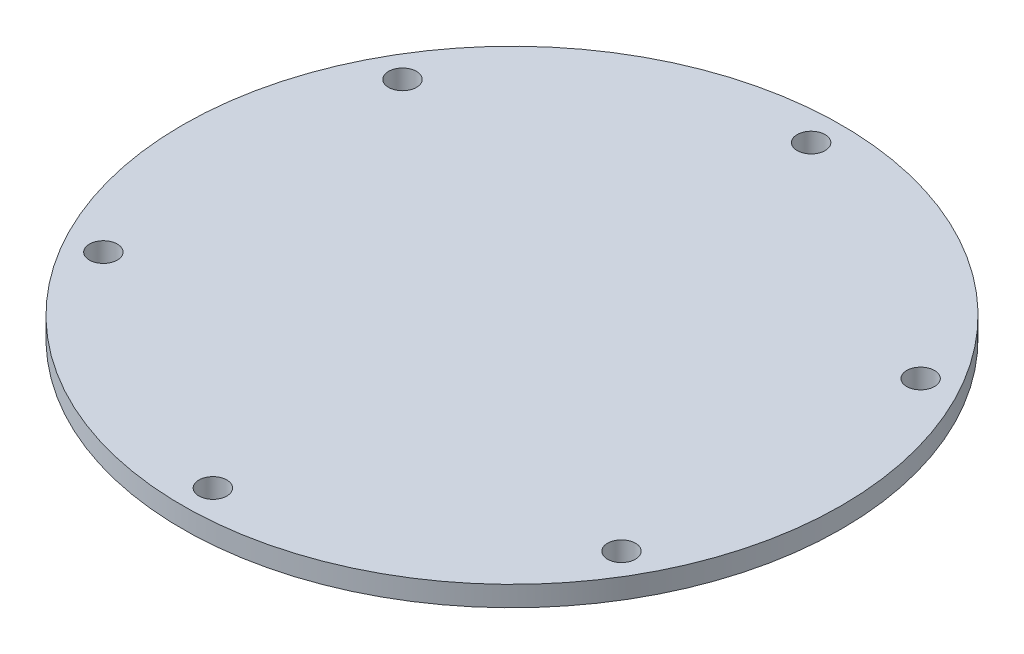
ISO-10303-21;
HEADER;
FILE_DESCRIPTION(('STEP AP214'),'2;1');
FILE_NAME('part.step','',(''),(''),'','','');
FILE_SCHEMA(('AUTOMOTIVE_DESIGN { 1 0 10303 214 1 1 1 1 }'));
ENDSEC;
DATA;
#1=APPLICATION_CONTEXT('core data for automotive mechanical design processes');
#2=APPLICATION_PROTOCOL_DEFINITION('international standard','automotive_design',2000,#1);
#3=PRODUCT_CONTEXT('',#1,'mechanical');
#4=PRODUCT('Part','Part','',(#3));
#5=PRODUCT_RELATED_PRODUCT_CATEGORY('part','',(#4));
#6=PRODUCT_DEFINITION_FORMATION('','',#4);
#7=PRODUCT_DEFINITION_CONTEXT('part definition',#1,'design');
#8=PRODUCT_DEFINITION('design','',#6,#7);
#9=PRODUCT_DEFINITION_SHAPE('','',#8);
#10=(LENGTH_UNIT() NAMED_UNIT(*) SI_UNIT(.MILLI.,.METRE.));
#11=(NAMED_UNIT(*) PLANE_ANGLE_UNIT() SI_UNIT($,.RADIAN.));
#12=(NAMED_UNIT(*) SI_UNIT($,.STERADIAN.) SOLID_ANGLE_UNIT());
#13=UNCERTAINTY_MEASURE_WITH_UNIT(LENGTH_MEASURE(1.E-05),#10,'distance_accuracy_value','');
#14=(GEOMETRIC_REPRESENTATION_CONTEXT(3) GLOBAL_UNCERTAINTY_ASSIGNED_CONTEXT((#13)) GLOBAL_UNIT_ASSIGNED_CONTEXT((#10,
#11,#12)) REPRESENTATION_CONTEXT('',''));
#15=CARTESIAN_POINT('',(0.,0.,0.));
#16=DIRECTION('',(0.,0.,1.));
#17=DIRECTION('',(1.,0.,0.));
#18=AXIS2_PLACEMENT_3D('',#15,#16,#17);
#19=CARTESIAN_POINT('',(-65.,-4.00000000000001,0.));
#20=DIRECTION('',(0.,-1.,0.));
#21=DIRECTION('',(1.,0.,0.));
#22=AXIS2_PLACEMENT_3D('',#19,#20,#21);
#23=PLANE('',#22);
#24=CARTESIAN_POINT('',(-51.0954988232815,-4.00000000000001,-29.5000000000006));
#25=DIRECTION('',(0.,-1.,0.));
#26=DIRECTION('',(0.,0.,-1.));
#27=AXIS2_PLACEMENT_3D('',#24,#25,#26);
#28=CIRCLE('',#27,2.74999999999999);
#29=CARTESIAN_POINT('',(-51.0954988232815,-4.00000000000001,-32.2500000000006));
#30=VERTEX_POINT('',#29);
#31=EDGE_CURVE('E181',#30,#30,#28,.T.);
#32=ORIENTED_EDGE('',*,*,#31,.F.);
#33=EDGE_LOOP('',(#32));
#34=FACE_BOUND('',#33,.T.);
#35=CARTESIAN_POINT('',(-51.0954988232822,-4.00000000000001,29.4999999999995));
#36=DIRECTION('',(0.,-1.,0.));
#37=DIRECTION('',(0.,0.,-1.));
#38=AXIS2_PLACEMENT_3D('',#35,#36,#37);
#39=CIRCLE('',#38,2.74999999999999);
#40=CARTESIAN_POINT('',(-51.0954988232822,-4.00000000000001,26.7499999999995));
#41=VERTEX_POINT('',#40);
#42=EDGE_CURVE('E101',#41,#41,#39,.T.);
#43=ORIENTED_EDGE('',*,*,#42,.F.);
#44=EDGE_LOOP('',(#43));
#45=FACE_BOUND('',#44,.T.);
#46=CARTESIAN_POINT('',(0.,-3.99999999999999,59.));
#47=DIRECTION('',(0.,-1.,0.));
#48=DIRECTION('',(0.,0.,-1.));
#49=AXIS2_PLACEMENT_3D('',#46,#47,#48);
#50=CIRCLE('',#49,2.74999999999999);
#51=CARTESIAN_POINT('',(0.,-3.99999999999999,56.25));
#52=VERTEX_POINT('',#51);
#53=EDGE_CURVE('E114',#52,#52,#50,.T.);
#54=ORIENTED_EDGE('',*,*,#53,.F.);
#55=EDGE_LOOP('',(#54));
#56=FACE_BOUND('',#55,.T.);
#57=CARTESIAN_POINT('',(51.0954988232818,-3.99999999999998,29.5000000000002));
#58=DIRECTION('',(0.,-1.,0.));
#59=DIRECTION('',(0.,0.,-1.));
#60=AXIS2_PLACEMENT_3D('',#57,#58,#59);
#61=CIRCLE('',#60,2.74999999999999);
#62=CARTESIAN_POINT('',(51.0954988232818,-3.99999999999998,26.7500000000003));
#63=VERTEX_POINT('',#62);
#64=EDGE_CURVE('E128',#63,#63,#61,.T.);
#65=ORIENTED_EDGE('',*,*,#64,.F.);
#66=EDGE_LOOP('',(#65));
#67=FACE_BOUND('',#66,.T.);
#68=CARTESIAN_POINT('',(51.095498823282,-3.99999999999998,-29.4999999999999));
#69=DIRECTION('',(0.,-1.,0.));
#70=DIRECTION('',(0.,0.,-1.));
#71=AXIS2_PLACEMENT_3D('',#68,#69,#70);
#72=CIRCLE('',#71,2.74999999999999);
#73=CARTESIAN_POINT('',(51.095498823282,-3.99999999999998,-32.2499999999999));
#74=VERTEX_POINT('',#73);
#75=EDGE_CURVE('E137',#74,#74,#72,.T.);
#76=ORIENTED_EDGE('',*,*,#75,.F.);
#77=EDGE_LOOP('',(#76));
#78=FACE_BOUND('',#77,.T.);
#79=CARTESIAN_POINT('',(0.,-3.99999999999999,-59.));
#80=DIRECTION('',(0.,-1.,0.));
#81=DIRECTION('',(0.,0.,-1.));
#82=AXIS2_PLACEMENT_3D('',#79,#80,#81);
#83=CIRCLE('',#82,2.74999999999999);
#84=CARTESIAN_POINT('',(0.,-3.99999999999999,-61.75));
#85=VERTEX_POINT('',#84);
#86=EDGE_CURVE('E145',#85,#85,#83,.T.);
#87=ORIENTED_EDGE('',*,*,#86,.F.);
#88=EDGE_LOOP('',(#87));
#89=FACE_BOUND('',#88,.T.);
#90=CARTESIAN_POINT('',(0.,-3.99999999999999,0.));
#91=DIRECTION('',(0.,1.,0.));
#92=DIRECTION('',(-1.,0.,0.));
#93=AXIS2_PLACEMENT_3D('',#90,#91,#92);
#94=CIRCLE('',#93,44.);
#95=CARTESIAN_POINT('',(-44.,-4.,0.));
#96=VERTEX_POINT('',#95);
#97=EDGE_CURVE('E80',#96,#96,#94,.T.);
#98=ORIENTED_EDGE('',*,*,#97,.T.);
#99=EDGE_LOOP('',(#98));
#100=FACE_BOUND('',#99,.T.);
#101=CARTESIAN_POINT('',(0.,-3.99999999999999,0.));
#102=DIRECTION('',(0.,1.,0.));
#103=DIRECTION('',(-1.,0.,0.));
#104=AXIS2_PLACEMENT_3D('',#101,#102,#103);
#105=CIRCLE('',#104,65.);
#106=CARTESIAN_POINT('',(-65.,-4.00000000000001,0.));
#107=VERTEX_POINT('',#106);
#108=EDGE_CURVE('E11',#107,#107,#105,.T.);
#109=ORIENTED_EDGE('',*,*,#108,.F.);
#110=EDGE_LOOP('',(#109));
#111=FACE_BOUND('',#110,.T.);
#112=ADVANCED_FACE('F45',(#34,#45,#56,#67,#78,#89,#100,#111),#23,.T.);
#113=CARTESIAN_POINT('',(0.,59.4980386112404,0.));
#114=DIRECTION('',(0.,1.,0.));
#115=DIRECTION('',(-1.,0.,0.));
#116=AXIS2_PLACEMENT_3D('',#113,#114,#115);
#117=CYLINDRICAL_SURFACE('',#116,65.);
#118=ORIENTED_EDGE('',*,*,#108,.T.);
#119=EDGE_LOOP('',(#118));
#120=FACE_BOUND('',#119,.T.);
#121=CARTESIAN_POINT('',(0.,0.,0.));
#122=DIRECTION('',(0.,1.,0.));
#123=DIRECTION('',(-1.,0.,0.));
#124=AXIS2_PLACEMENT_3D('',#121,#122,#123);
#125=CIRCLE('',#124,65.);
#126=CARTESIAN_POINT('',(-65.,0.,0.));
#127=VERTEX_POINT('',#126);
#128=EDGE_CURVE('E53',#127,#127,#125,.T.);
#129=ORIENTED_EDGE('',*,*,#128,.F.);
#130=EDGE_LOOP('',(#129));
#131=FACE_BOUND('',#130,.T.);
#132=ADVANCED_FACE('F173',(#120,#131),#117,.T.);
#133=CARTESIAN_POINT('',(0.,0.,0.));
#134=DIRECTION('',(0.,1.,0.));
#135=DIRECTION('',(-1.,0.,0.));
#136=AXIS2_PLACEMENT_3D('',#133,#134,#135);
#137=PLANE('',#136);
#138=CARTESIAN_POINT('',(-51.0954988232815,0.,-29.5000000000006));
#139=DIRECTION('',(0.,-1.,0.));
#140=DIRECTION('',(0.,0.,-1.));
#141=AXIS2_PLACEMENT_3D('',#138,#139,#140);
#142=CIRCLE('',#141,2.75);
#143=CARTESIAN_POINT('',(-51.0954988232815,0.,-32.2500000000006));
#144=VERTEX_POINT('',#143);
#145=EDGE_CURVE('E108',#144,#144,#142,.T.);
#146=ORIENTED_EDGE('',*,*,#145,.T.);
#147=EDGE_LOOP('',(#146));
#148=FACE_BOUND('',#147,.T.);
#149=CARTESIAN_POINT('',(-51.0954988232822,0.,29.4999999999995));
#150=DIRECTION('',(0.,-1.,0.));
#151=DIRECTION('',(0.,0.,-1.));
#152=AXIS2_PLACEMENT_3D('',#149,#150,#151);
#153=CIRCLE('',#152,2.75);
#154=CARTESIAN_POINT('',(-51.0954988232822,0.,26.7499999999995));
#155=VERTEX_POINT('',#154);
#156=EDGE_CURVE('E107',#155,#155,#153,.T.);
#157=ORIENTED_EDGE('',*,*,#156,.T.);
#158=EDGE_LOOP('',(#157));
#159=FACE_BOUND('',#158,.T.);
#160=CARTESIAN_POINT('',(0.,0.,59.));
#161=DIRECTION('',(0.,-1.,0.));
#162=DIRECTION('',(0.,0.,-1.));
#163=AXIS2_PLACEMENT_3D('',#160,#161,#162);
#164=CIRCLE('',#163,2.75);
#165=CARTESIAN_POINT('',(0.,0.,56.25));
#166=VERTEX_POINT('',#165);
#167=EDGE_CURVE('E123',#166,#166,#164,.T.);
#168=ORIENTED_EDGE('',*,*,#167,.T.);
#169=EDGE_LOOP('',(#168));
#170=FACE_BOUND('',#169,.T.);
#171=CARTESIAN_POINT('',(51.0954988232818,0.,29.5000000000002));
#172=DIRECTION('',(0.,-1.,0.));
#173=DIRECTION('',(0.,0.,-1.));
#174=AXIS2_PLACEMENT_3D('',#171,#172,#173);
#175=CIRCLE('',#174,2.75);
#176=CARTESIAN_POINT('',(51.0954988232818,0.,26.7500000000003));
#177=VERTEX_POINT('',#176);
#178=EDGE_CURVE('E132',#177,#177,#175,.T.);
#179=ORIENTED_EDGE('',*,*,#178,.T.);
#180=EDGE_LOOP('',(#179));
#181=FACE_BOUND('',#180,.T.);
#182=CARTESIAN_POINT('',(51.095498823282,0.,-29.4999999999999));
#183=DIRECTION('',(0.,-1.,0.));
#184=DIRECTION('',(0.,0.,-1.));
#185=AXIS2_PLACEMENT_3D('',#182,#183,#184);
#186=CIRCLE('',#185,2.75);
#187=CARTESIAN_POINT('',(51.095498823282,0.,-32.2499999999999));
#188=VERTEX_POINT('',#187);
#189=EDGE_CURVE('E141',#188,#188,#186,.T.);
#190=ORIENTED_EDGE('',*,*,#189,.T.);
#191=EDGE_LOOP('',(#190));
#192=FACE_BOUND('',#191,.T.);
#193=CARTESIAN_POINT('',(0.,0.,-59.));
#194=DIRECTION('',(0.,-1.,0.));
#195=DIRECTION('',(0.,0.,-1.));
#196=AXIS2_PLACEMENT_3D('',#193,#194,#195);
#197=CIRCLE('',#196,2.75);
#198=CARTESIAN_POINT('',(0.,0.,-61.75));
#199=VERTEX_POINT('',#198);
#200=EDGE_CURVE('E86',#199,#199,#197,.T.);
#201=ORIENTED_EDGE('',*,*,#200,.T.);
#202=EDGE_LOOP('',(#201));
#203=FACE_BOUND('',#202,.T.);
#204=ORIENTED_EDGE('',*,*,#128,.T.);
#205=EDGE_LOOP('',(#204));
#206=FACE_BOUND('',#205,.T.);
#207=ADVANCED_FACE('F155',(#148,#159,#170,#181,#192,#203,#206),#137,.T.);
#208=CARTESIAN_POINT('',(-41.,-4.00000000000001,0.));
#209=DIRECTION('',(0.,-1.,0.));
#210=DIRECTION('',(1.,0.,0.));
#211=AXIS2_PLACEMENT_3D('',#208,#209,#210);
#212=PLANE('',#211);
#213=CARTESIAN_POINT('',(0.,-3.99999999999999,0.));
#214=DIRECTION('',(0.,1.,0.));
#215=DIRECTION('',(-1.,0.,0.));
#216=AXIS2_PLACEMENT_3D('',#213,#214,#215);
#217=CIRCLE('',#216,41.);
#218=CARTESIAN_POINT('',(-41.,-4.,0.));
#219=VERTEX_POINT('',#218);
#220=EDGE_CURVE('E61',#219,#219,#217,.T.);
#221=ORIENTED_EDGE('',*,*,#220,.F.);
#222=EDGE_LOOP('',(#221));
#223=FACE_BOUND('',#222,.T.);
#224=ADVANCED_FACE('F226',(#223),#212,.T.);
#225=CARTESIAN_POINT('',(0.,59.4980386112404,0.));
#226=DIRECTION('',(0.,1.,0.));
#227=DIRECTION('',(-1.,0.,0.));
#228=AXIS2_PLACEMENT_3D('',#225,#226,#227);
#229=CYLINDRICAL_SURFACE('',#228,41.);
#230=ORIENTED_EDGE('',*,*,#220,.T.);
#231=EDGE_LOOP('',(#230));
#232=FACE_BOUND('',#231,.T.);
#233=CARTESIAN_POINT('',(0.,-5.99999999999999,0.));
#234=DIRECTION('',(0.,1.,0.));
#235=DIRECTION('',(-1.,0.,0.));
#236=AXIS2_PLACEMENT_3D('',#233,#234,#235);
#237=CIRCLE('',#236,41.);
#238=CARTESIAN_POINT('',(-41.,-6.,0.));
#239=VERTEX_POINT('',#238);
#240=EDGE_CURVE('E68',#239,#239,#237,.T.);
#241=ORIENTED_EDGE('',*,*,#240,.F.);
#242=EDGE_LOOP('',(#241));
#243=FACE_BOUND('',#242,.T.);
#244=ADVANCED_FACE('F241',(#232,#243),#229,.F.);
#245=CARTESIAN_POINT('',(-44.,-6.00000000000001,0.));
#246=DIRECTION('',(0.,-1.,0.));
#247=DIRECTION('',(1.,0.,0.));
#248=AXIS2_PLACEMENT_3D('',#245,#246,#247);
#249=PLANE('',#248);
#250=ORIENTED_EDGE('',*,*,#240,.T.);
#251=EDGE_LOOP('',(#250));
#252=FACE_BOUND('',#251,.T.);
#253=CARTESIAN_POINT('',(0.,-5.99999999999999,0.));
#254=DIRECTION('',(0.,1.,0.));
#255=DIRECTION('',(-1.,0.,0.));
#256=AXIS2_PLACEMENT_3D('',#253,#254,#255);
#257=CIRCLE('',#256,44.);
#258=CARTESIAN_POINT('',(-44.,-6.00000000000001,0.));
#259=VERTEX_POINT('',#258);
#260=EDGE_CURVE('E85',#259,#259,#257,.T.);
#261=ORIENTED_EDGE('',*,*,#260,.F.);
#262=EDGE_LOOP('',(#261));
#263=FACE_BOUND('',#262,.T.);
#264=ADVANCED_FACE('F169',(#252,#263),#249,.T.);
#265=CARTESIAN_POINT('',(0.,59.4980386112404,0.));
#266=DIRECTION('',(0.,1.,0.));
#267=DIRECTION('',(-1.,0.,0.));
#268=AXIS2_PLACEMENT_3D('',#265,#266,#267);
#269=CYLINDRICAL_SURFACE('',#268,44.);
#270=ORIENTED_EDGE('',*,*,#260,.T.);
#271=EDGE_LOOP('',(#270));
#272=FACE_BOUND('',#271,.T.);
#273=ORIENTED_EDGE('',*,*,#97,.F.);
#274=EDGE_LOOP('',(#273));
#275=FACE_BOUND('',#274,.T.);
#276=ADVANCED_FACE('F160',(#272,#275),#269,.T.);
#277=CARTESIAN_POINT('',(0.,-3.99999999999999,-59.));
#278=DIRECTION('',(0.,-1.,0.));
#279=DIRECTION('',(0.,0.,-1.));
#280=AXIS2_PLACEMENT_3D('',#277,#278,#279);
#281=CYLINDRICAL_SURFACE('',#280,2.74999999999999);
#282=ORIENTED_EDGE('',*,*,#200,.F.);
#283=EDGE_LOOP('',(#282));
#284=FACE_BOUND('',#283,.T.);
#285=ORIENTED_EDGE('',*,*,#86,.T.);
#286=EDGE_LOOP('',(#285));
#287=FACE_BOUND('',#286,.T.);
#288=ADVANCED_FACE('F157',(#284,#287),#281,.F.);
#289=CARTESIAN_POINT('',(51.095498823282,-3.99999999999998,-29.4999999999999));
#290=DIRECTION('',(0.,-1.,0.));
#291=DIRECTION('',(0.,0.,-1.));
#292=AXIS2_PLACEMENT_3D('',#289,#290,#291);
#293=CYLINDRICAL_SURFACE('',#292,2.74999999999999);
#294=ORIENTED_EDGE('',*,*,#189,.F.);
#295=EDGE_LOOP('',(#294));
#296=FACE_BOUND('',#295,.T.);
#297=ORIENTED_EDGE('',*,*,#75,.T.);
#298=EDGE_LOOP('',(#297));
#299=FACE_BOUND('',#298,.T.);
#300=ADVANCED_FACE('F159',(#296,#299),#293,.F.);
#301=CARTESIAN_POINT('',(51.0954988232818,-3.99999999999998,29.5000000000002));
#302=DIRECTION('',(0.,-1.,0.));
#303=DIRECTION('',(0.,0.,-1.));
#304=AXIS2_PLACEMENT_3D('',#301,#302,#303);
#305=CYLINDRICAL_SURFACE('',#304,2.74999999999999);
#306=ORIENTED_EDGE('',*,*,#178,.F.);
#307=EDGE_LOOP('',(#306));
#308=FACE_BOUND('',#307,.T.);
#309=ORIENTED_EDGE('',*,*,#64,.T.);
#310=EDGE_LOOP('',(#309));
#311=FACE_BOUND('',#310,.T.);
#312=ADVANCED_FACE('F166',(#308,#311),#305,.F.);
#313=CARTESIAN_POINT('',(0.,-3.99999999999999,59.));
#314=DIRECTION('',(0.,-1.,0.));
#315=DIRECTION('',(0.,0.,-1.));
#316=AXIS2_PLACEMENT_3D('',#313,#314,#315);
#317=CYLINDRICAL_SURFACE('',#316,2.74999999999999);
#318=ORIENTED_EDGE('',*,*,#167,.F.);
#319=EDGE_LOOP('',(#318));
#320=FACE_BOUND('',#319,.T.);
#321=ORIENTED_EDGE('',*,*,#53,.T.);
#322=EDGE_LOOP('',(#321));
#323=FACE_BOUND('',#322,.T.);
#324=ADVANCED_FACE('F198',(#320,#323),#317,.F.);
#325=CARTESIAN_POINT('',(-51.0954988232822,-4.00000000000001,29.4999999999995));
#326=DIRECTION('',(0.,-1.,0.));
#327=DIRECTION('',(0.,0.,-1.));
#328=AXIS2_PLACEMENT_3D('',#325,#326,#327);
#329=CYLINDRICAL_SURFACE('',#328,2.74999999999999);
#330=ORIENTED_EDGE('',*,*,#156,.F.);
#331=EDGE_LOOP('',(#330));
#332=FACE_BOUND('',#331,.T.);
#333=ORIENTED_EDGE('',*,*,#42,.T.);
#334=EDGE_LOOP('',(#333));
#335=FACE_BOUND('',#334,.T.);
#336=ADVANCED_FACE('F204',(#332,#335),#329,.F.);
#337=CARTESIAN_POINT('',(-51.0954988232815,-4.00000000000001,-29.5000000000006));
#338=DIRECTION('',(0.,-1.,0.));
#339=DIRECTION('',(0.,0.,-1.));
#340=AXIS2_PLACEMENT_3D('',#337,#338,#339);
#341=CYLINDRICAL_SURFACE('',#340,2.74999999999999);
#342=ORIENTED_EDGE('',*,*,#145,.F.);
#343=EDGE_LOOP('',(#342));
#344=FACE_BOUND('',#343,.T.);
#345=ORIENTED_EDGE('',*,*,#31,.T.);
#346=EDGE_LOOP('',(#345));
#347=FACE_BOUND('',#346,.T.);
#348=ADVANCED_FACE('F211',(#344,#347),#341,.F.);
#349=CLOSED_SHELL('',(#112,#132,#207,#224,#244,#264,#276,#288,#300,#312,#324,#336,#348));
#350=MANIFOLD_SOLID_BREP('B2',#349);
#351=ADVANCED_BREP_SHAPE_REPRESENTATION('',(#18,#350),#14);
#352=SHAPE_DEFINITION_REPRESENTATION(#9,#351);
ENDSEC;
END-ISO-10303-21;
